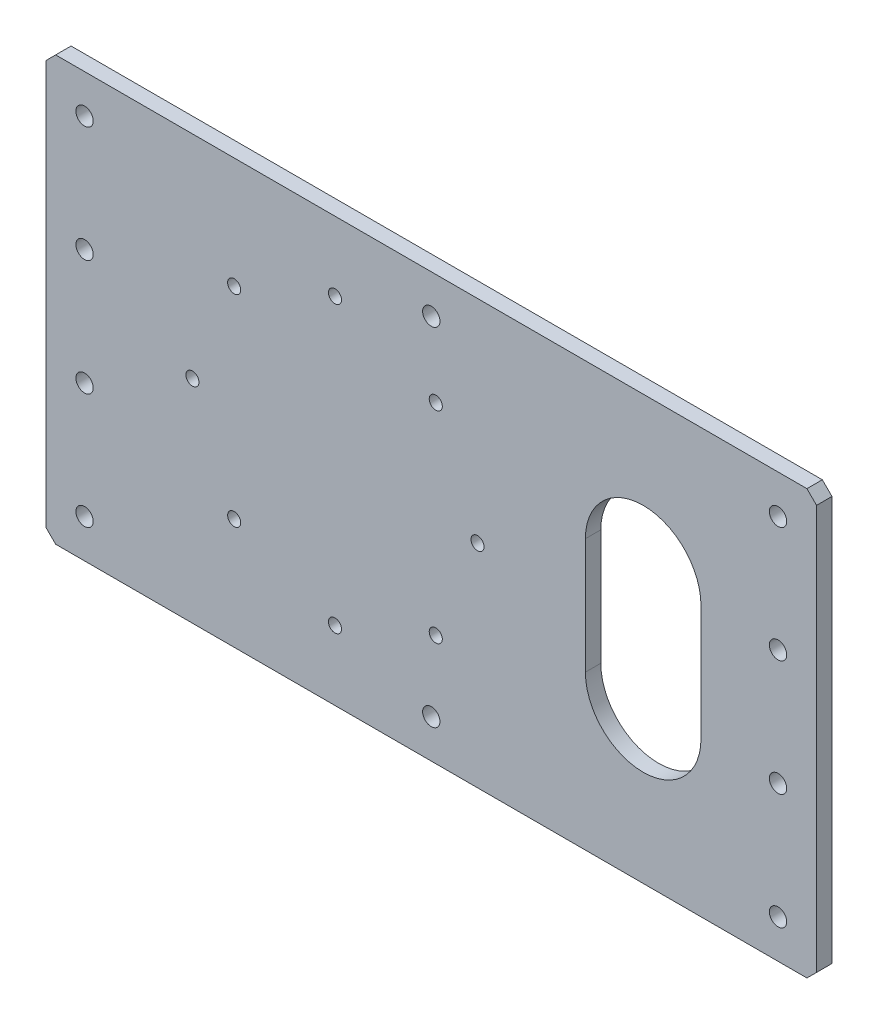
ISO-10303-21;
HEADER;
FILE_DESCRIPTION(('STEP AP214'),'2;1');
FILE_NAME('part.step','',(''),(''),'','','');
FILE_SCHEMA(('AUTOMOTIVE_DESIGN { 1 0 10303 214 1 1 1 1 }'));
ENDSEC;
DATA;
#1=APPLICATION_CONTEXT('core data for automotive mechanical design processes');
#2=APPLICATION_PROTOCOL_DEFINITION('international standard','automotive_design',2000,#1);
#3=PRODUCT_CONTEXT('',#1,'mechanical');
#4=PRODUCT('Part','Part','',(#3));
#5=PRODUCT_RELATED_PRODUCT_CATEGORY('part','',(#4));
#6=PRODUCT_DEFINITION_FORMATION('','',#4);
#7=PRODUCT_DEFINITION_CONTEXT('part definition',#1,'design');
#8=PRODUCT_DEFINITION('design','',#6,#7);
#9=PRODUCT_DEFINITION_SHAPE('','',#8);
#10=(LENGTH_UNIT() NAMED_UNIT(*) SI_UNIT(.MILLI.,.METRE.));
#11=(NAMED_UNIT(*) PLANE_ANGLE_UNIT() SI_UNIT($,.RADIAN.));
#12=(NAMED_UNIT(*) SI_UNIT($,.STERADIAN.) SOLID_ANGLE_UNIT());
#13=UNCERTAINTY_MEASURE_WITH_UNIT(LENGTH_MEASURE(1.E-05),#10,'distance_accuracy_value','');
#14=(GEOMETRIC_REPRESENTATION_CONTEXT(3) GLOBAL_UNCERTAINTY_ASSIGNED_CONTEXT((#13)) GLOBAL_UNIT_ASSIGNED_CONTEXT((#10,
#11,#12)) REPRESENTATION_CONTEXT('',''));
#15=CARTESIAN_POINT('',(0.,0.,0.));
#16=DIRECTION('',(0.,0.,1.));
#17=DIRECTION('',(1.,0.,0.));
#18=AXIS2_PLACEMENT_3D('',#15,#16,#17);
#19=CARTESIAN_POINT('',(0.,0.,0.));
#20=DIRECTION('',(0.,0.,1.));
#21=DIRECTION('',(1.,0.,0.));
#22=AXIS2_PLACEMENT_3D('',#19,#20,#21);
#23=PLANE('',#22);
#24=CARTESIAN_POINT('',(0.,90.,0.));
#25=DIRECTION('',(0.,0.,-1.));
#26=DIRECTION('',(-1.,0.,0.));
#27=AXIS2_PLACEMENT_3D('',#24,#25,#26);
#28=CIRCLE('',#27,4.5);
#29=CARTESIAN_POINT('',(-4.5,90.,0.));
#30=VERTEX_POINT('',#29);
#31=EDGE_CURVE('E271',#30,#30,#28,.T.);
#32=ORIENTED_EDGE('',*,*,#31,.F.);
#33=EDGE_LOOP('',(#32));
#34=FACE_BOUND('',#33,.T.);
#35=CARTESIAN_POINT('',(0.,-90.,0.));
#36=DIRECTION('',(0.,0.,-1.));
#37=DIRECTION('',(-1.,0.,0.));
#38=AXIS2_PLACEMENT_3D('',#35,#36,#37);
#39=CIRCLE('',#38,4.5);
#40=CARTESIAN_POINT('',(-4.5,-90.,0.));
#41=VERTEX_POINT('',#40);
#42=EDGE_CURVE('E277',#41,#41,#39,.T.);
#43=ORIENTED_EDGE('',*,*,#42,.F.);
#44=EDGE_LOOP('',(#43));
#45=FACE_BOUND('',#44,.T.);
#46=CARTESIAN_POINT('',(2.32590180780423,-52.3259018078048,0.));
#47=DIRECTION('',(0.,0.,-1.));
#48=DIRECTION('',(-1.,0.,0.));
#49=AXIS2_PLACEMENT_3D('',#46,#47,#48);
#50=CIRCLE('',#49,3.39999999999999);
#51=CARTESIAN_POINT('',(-1.07409819219576,-52.3259018078048,0.));
#52=VERTEX_POINT('',#51);
#53=EDGE_CURVE('E295',#52,#52,#50,.T.);
#54=ORIENTED_EDGE('',*,*,#53,.F.);
#55=EDGE_LOOP('',(#54));
#56=FACE_BOUND('',#55,.T.);
#57=CARTESIAN_POINT('',(-50.0000000000003,-74.,0.));
#58=DIRECTION('',(0.,0.,-1.));
#59=DIRECTION('',(-1.,0.,0.));
#60=AXIS2_PLACEMENT_3D('',#57,#58,#59);
#61=CIRCLE('',#60,3.4);
#62=CARTESIAN_POINT('',(-53.4000000000003,-74.,0.));
#63=VERTEX_POINT('',#62);
#64=EDGE_CURVE('E319',#63,#63,#61,.T.);
#65=ORIENTED_EDGE('',*,*,#64,.F.);
#66=EDGE_LOOP('',(#65));
#67=FACE_BOUND('',#66,.T.);
#68=CARTESIAN_POINT('',(24.,0.,0.));
#69=DIRECTION('',(0.,0.,-1.));
#70=DIRECTION('',(-1.,0.,0.));
#71=AXIS2_PLACEMENT_3D('',#68,#69,#70);
#72=CIRCLE('',#71,3.4);
#73=CARTESIAN_POINT('',(20.6,0.,0.));
#74=VERTEX_POINT('',#73);
#75=EDGE_CURVE('E325',#74,#74,#72,.T.);
#76=ORIENTED_EDGE('',*,*,#75,.F.);
#77=EDGE_LOOP('',(#76));
#78=FACE_BOUND('',#77,.T.);
#79=DIRECTION('',(0.,-1.,0.));
#80=VECTOR('',#79,1.);
#81=CARTESIAN_POINT('',(140.,30.,0.));
#82=LINE('',#81,#80);
#83=CARTESIAN_POINT('',(140.,30.,0.));
#84=VERTEX_POINT('',#83);
#85=CARTESIAN_POINT('',(140.,-30.,0.));
#86=VERTEX_POINT('',#85);
#87=EDGE_CURVE('E146',#84,#86,#82,.T.);
#88=ORIENTED_EDGE('',*,*,#87,.F.);
#89=CARTESIAN_POINT('',(110.,30.,0.));
#90=DIRECTION('',(0.,0.,-1.));
#91=DIRECTION('',(-1.,0.,0.));
#92=AXIS2_PLACEMENT_3D('',#89,#90,#91);
#93=CIRCLE('',#92,30.);
#94=CARTESIAN_POINT('',(80.0000000000001,30.,0.));
#95=VERTEX_POINT('',#94);
#96=EDGE_CURVE('E151',#95,#84,#93,.T.);
#97=ORIENTED_EDGE('',*,*,#96,.F.);
#98=DIRECTION('',(0.,1.,0.));
#99=VECTOR('',#98,1.);
#100=CARTESIAN_POINT('',(80.0000000000001,30.,0.));
#101=LINE('',#100,#99);
#102=CARTESIAN_POINT('',(80.0000000000001,-30.,0.));
#103=VERTEX_POINT('',#102);
#104=EDGE_CURVE('E155',#103,#95,#101,.T.);
#105=ORIENTED_EDGE('',*,*,#104,.F.);
#106=CARTESIAN_POINT('',(110.,-30.,0.));
#107=DIRECTION('',(0.,0.,-1.));
#108=DIRECTION('',(-1.,0.,0.));
#109=AXIS2_PLACEMENT_3D('',#106,#107,#108);
#110=CIRCLE('',#109,30.);
#111=EDGE_CURVE('E135',#86,#103,#110,.T.);
#112=ORIENTED_EDGE('',*,*,#111,.F.);
#113=EDGE_LOOP('',(#88,#97,#105,#112));
#114=FACE_BOUND('',#113,.T.);
#115=CARTESIAN_POINT('',(-180.,90.,0.));
#116=DIRECTION('',(0.,0.,-1.));
#117=DIRECTION('',(-1.,0.,0.));
#118=AXIS2_PLACEMENT_3D('',#115,#116,#117);
#119=CIRCLE('',#118,4.49999999999999);
#120=CARTESIAN_POINT('',(-184.5,90.,0.));
#121=VERTEX_POINT('',#120);
#122=EDGE_CURVE('E181',#121,#121,#119,.T.);
#123=ORIENTED_EDGE('',*,*,#122,.F.);
#124=EDGE_LOOP('',(#123));
#125=FACE_BOUND('',#124,.T.);
#126=CARTESIAN_POINT('',(-180.000000000001,-30.,0.));
#127=DIRECTION('',(0.,0.,-1.));
#128=DIRECTION('',(-1.,0.,0.));
#129=AXIS2_PLACEMENT_3D('',#126,#127,#128);
#130=CIRCLE('',#129,4.49999999999999);
#131=CARTESIAN_POINT('',(-184.500000000001,-30.,0.));
#132=VERTEX_POINT('',#131);
#133=EDGE_CURVE('E185',#132,#132,#130,.T.);
#134=ORIENTED_EDGE('',*,*,#133,.F.);
#135=EDGE_LOOP('',(#134));
#136=FACE_BOUND('',#135,.T.);
#137=CARTESIAN_POINT('',(-180.,-90.,0.));
#138=DIRECTION('',(0.,0.,-1.));
#139=DIRECTION('',(1.,0.,0.));
#140=AXIS2_PLACEMENT_3D('',#137,#138,#139);
#141=CIRCLE('',#140,4.49999999999999);
#142=CARTESIAN_POINT('',(-175.5,-90.,0.));
#143=VERTEX_POINT('',#142);
#144=EDGE_CURVE('E188',#143,#143,#141,.T.);
#145=ORIENTED_EDGE('',*,*,#144,.F.);
#146=EDGE_LOOP('',(#145));
#147=FACE_BOUND('',#146,.T.);
#148=CARTESIAN_POINT('',(180.,-90.,0.));
#149=DIRECTION('',(0.,0.,-1.));
#150=DIRECTION('',(-1.,0.,0.));
#151=AXIS2_PLACEMENT_3D('',#148,#149,#150);
#152=CIRCLE('',#151,4.49999999999999);
#153=CARTESIAN_POINT('',(175.5,-90.,0.));
#154=VERTEX_POINT('',#153);
#155=EDGE_CURVE('E178',#154,#154,#152,.T.);
#156=ORIENTED_EDGE('',*,*,#155,.F.);
#157=EDGE_LOOP('',(#156));
#158=FACE_BOUND('',#157,.T.);
#159=CARTESIAN_POINT('',(180.,30.,0.));
#160=DIRECTION('',(0.,0.,-1.));
#161=DIRECTION('',(1.,0.,0.));
#162=AXIS2_PLACEMENT_3D('',#159,#160,#161);
#163=CIRCLE('',#162,4.49999999999999);
#164=CARTESIAN_POINT('',(184.5,30.,0.));
#165=VERTEX_POINT('',#164);
#166=EDGE_CURVE('E171',#165,#165,#163,.T.);
#167=ORIENTED_EDGE('',*,*,#166,.F.);
#168=EDGE_LOOP('',(#167));
#169=FACE_BOUND('',#168,.T.);
#170=CARTESIAN_POINT('',(180.,90.,0.));
#171=DIRECTION('',(0.,0.,-1.));
#172=DIRECTION('',(1.,0.,0.));
#173=AXIS2_PLACEMENT_3D('',#170,#171,#172);
#174=CIRCLE('',#173,4.49999999999999);
#175=CARTESIAN_POINT('',(184.5,90.,0.));
#176=VERTEX_POINT('',#175);
#177=EDGE_CURVE('E174',#176,#176,#174,.T.);
#178=ORIENTED_EDGE('',*,*,#177,.F.);
#179=EDGE_LOOP('',(#178));
#180=FACE_BOUND('',#179,.T.);
#181=CARTESIAN_POINT('',(180.000000000001,-30.,0.));
#182=DIRECTION('',(0.,0.,-1.));
#183=DIRECTION('',(1.,0.,0.));
#184=AXIS2_PLACEMENT_3D('',#181,#182,#183);
#185=CIRCLE('',#184,4.49999999999999);
#186=CARTESIAN_POINT('',(184.500000000001,-30.,0.));
#187=VERTEX_POINT('',#186);
#188=EDGE_CURVE('E175',#187,#187,#185,.T.);
#189=ORIENTED_EDGE('',*,*,#188,.F.);
#190=EDGE_LOOP('',(#189));
#191=FACE_BOUND('',#190,.T.);
#192=CARTESIAN_POINT('',(-180.,30.,0.));
#193=DIRECTION('',(0.,0.,-1.));
#194=DIRECTION('',(-1.,0.,0.));
#195=AXIS2_PLACEMENT_3D('',#192,#193,#194);
#196=CIRCLE('',#195,4.49999999999999);
#197=CARTESIAN_POINT('',(-184.5,30.,0.));
#198=VERTEX_POINT('',#197);
#199=EDGE_CURVE('E184',#198,#198,#196,.T.);
#200=ORIENTED_EDGE('',*,*,#199,.F.);
#201=EDGE_LOOP('',(#200));
#202=FACE_BOUND('',#201,.T.);
#203=DIRECTION('',(1.,0.,0.));
#204=VECTOR('',#203,1.);
#205=CARTESIAN_POINT('',(200.,-110.,0.));
#206=LINE('',#205,#204);
#207=CARTESIAN_POINT('',(-195.,-110.,0.));
#208=VERTEX_POINT('',#207);
#209=CARTESIAN_POINT('',(195.,-110.,0.));
#210=VERTEX_POINT('',#209);
#211=EDGE_CURVE('E234',#208,#210,#206,.T.);
#212=ORIENTED_EDGE('',*,*,#211,.F.);
#213=DIRECTION('',(0.707106781186544,-0.707106781186551,0.));
#214=VECTOR('',#213,1.);
#215=CARTESIAN_POINT('',(-195.,-110.,0.));
#216=LINE('',#215,#214);
#217=CARTESIAN_POINT('',(-200.,-105.,0.));
#218=VERTEX_POINT('',#217);
#219=EDGE_CURVE('E251',#208,#218,#216,.F.);
#220=ORIENTED_EDGE('',*,*,#219,.T.);
#221=DIRECTION('',(0.,-1.,0.));
#222=VECTOR('',#221,1.);
#223=CARTESIAN_POINT('',(-200.,-110.,0.));
#224=LINE('',#223,#222);
#225=CARTESIAN_POINT('',(-200.,105.,0.));
#226=VERTEX_POINT('',#225);
#227=EDGE_CURVE('E219',#226,#218,#224,.T.);
#228=ORIENTED_EDGE('',*,*,#227,.F.);
#229=DIRECTION('',(-0.707106781186548,-0.707106781186548,0.));
#230=VECTOR('',#229,1.);
#231=CARTESIAN_POINT('',(-200.,105.,0.));
#232=LINE('',#231,#230);
#233=CARTESIAN_POINT('',(-195.,110.,0.));
#234=VERTEX_POINT('',#233);
#235=EDGE_CURVE('E249',#226,#234,#232,.F.);
#236=ORIENTED_EDGE('',*,*,#235,.T.);
#237=DIRECTION('',(-1.,0.,0.));
#238=VECTOR('',#237,1.);
#239=CARTESIAN_POINT('',(200.,110.,0.));
#240=LINE('',#239,#238);
#241=CARTESIAN_POINT('',(195.,110.,0.));
#242=VERTEX_POINT('',#241);
#243=EDGE_CURVE('E224',#242,#234,#240,.T.);
#244=ORIENTED_EDGE('',*,*,#243,.F.);
#245=DIRECTION('',(-0.707106781186544,0.707106781186551,0.));
#246=VECTOR('',#245,1.);
#247=CARTESIAN_POINT('',(195.,110.,0.));
#248=LINE('',#247,#246);
#249=CARTESIAN_POINT('',(200.,105.,0.));
#250=VERTEX_POINT('',#249);
#251=EDGE_CURVE('E245',#242,#250,#248,.F.);
#252=ORIENTED_EDGE('',*,*,#251,.T.);
#253=DIRECTION('',(0.,1.,0.));
#254=VECTOR('',#253,1.);
#255=CARTESIAN_POINT('',(200.,-110.,0.));
#256=LINE('',#255,#254);
#257=CARTESIAN_POINT('',(200.,-105.,0.));
#258=VERTEX_POINT('',#257);
#259=EDGE_CURVE('E237',#258,#250,#256,.T.);
#260=ORIENTED_EDGE('',*,*,#259,.F.);
#261=DIRECTION('',(0.707106781186551,0.707106781186544,0.));
#262=VECTOR('',#261,1.);
#263=CARTESIAN_POINT('',(200.,-105.,0.));
#264=LINE('',#263,#262);
#265=EDGE_CURVE('E247',#258,#210,#264,.F.);
#266=ORIENTED_EDGE('',*,*,#265,.T.);
#267=EDGE_LOOP('',(#212,#220,#228,#236,#244,#252,#260,#266));
#268=FACE_BOUND('',#267,.T.);
#269=CARTESIAN_POINT('',(-124.,5.22151766269019E-13,0.));
#270=DIRECTION('',(0.,0.,-1.));
#271=DIRECTION('',(-1.,0.,0.));
#272=AXIS2_PLACEMENT_3D('',#269,#270,#271);
#273=CIRCLE('',#272,3.4);
#274=CARTESIAN_POINT('',(-127.4,5.22151766269019E-13,0.));
#275=VERTEX_POINT('',#274);
#276=EDGE_CURVE('E313',#275,#275,#273,.T.);
#277=ORIENTED_EDGE('',*,*,#276,.F.);
#278=EDGE_LOOP('',(#277));
#279=FACE_BOUND('',#278,.T.);
#280=CARTESIAN_POINT('',(-49.9999999999992,74.,0.));
#281=DIRECTION('',(0.,0.,-1.));
#282=DIRECTION('',(-1.,0.,0.));
#283=AXIS2_PLACEMENT_3D('',#280,#281,#282);
#284=CIRCLE('',#283,3.4);
#285=CARTESIAN_POINT('',(-53.3999999999992,74.,0.));
#286=VERTEX_POINT('',#285);
#287=EDGE_CURVE('E307',#286,#286,#284,.T.);
#288=ORIENTED_EDGE('',*,*,#287,.F.);
#289=EDGE_LOOP('',(#288));
#290=FACE_BOUND('',#289,.T.);
#291=CARTESIAN_POINT('',(2.32590180780478,52.3259018078042,0.));
#292=DIRECTION('',(0.,0.,-1.));
#293=DIRECTION('',(-1.,0.,0.));
#294=AXIS2_PLACEMENT_3D('',#291,#292,#293);
#295=CIRCLE('',#294,3.39999999999999);
#296=CARTESIAN_POINT('',(-1.07409819219521,52.3259018078042,0.));
#297=VERTEX_POINT('',#296);
#298=EDGE_CURVE('E301',#297,#297,#295,.T.);
#299=ORIENTED_EDGE('',*,*,#298,.F.);
#300=EDGE_LOOP('',(#299));
#301=FACE_BOUND('',#300,.T.);
#302=CARTESIAN_POINT('',(-102.325901807804,-52.3259018078054,0.));
#303=DIRECTION('',(0.,0.,-1.));
#304=DIRECTION('',(-1.,0.,0.));
#305=AXIS2_PLACEMENT_3D('',#302,#303,#304);
#306=CIRCLE('',#305,3.39999999999999);
#307=CARTESIAN_POINT('',(-105.725901807804,-52.3259018078054,0.));
#308=VERTEX_POINT('',#307);
#309=EDGE_CURVE('E289',#308,#308,#306,.T.);
#310=ORIENTED_EDGE('',*,*,#309,.F.);
#311=EDGE_LOOP('',(#310));
#312=FACE_BOUND('',#311,.T.);
#313=CARTESIAN_POINT('',(-102.325901807804,52.3259018078051,0.));
#314=DIRECTION('',(0.,0.,-1.));
#315=DIRECTION('',(-1.,0.,0.));
#316=AXIS2_PLACEMENT_3D('',#313,#314,#315);
#317=CIRCLE('',#316,3.39999999999999);
#318=CARTESIAN_POINT('',(-105.725901807804,52.3259018078051,0.));
#319=VERTEX_POINT('',#318);
#320=EDGE_CURVE('E275',#319,#319,#317,.T.);
#321=ORIENTED_EDGE('',*,*,#320,.F.);
#322=EDGE_LOOP('',(#321));
#323=FACE_BOUND('',#322,.T.);
#324=ADVANCED_FACE('F37',(#34,#45,#56,#67,#78,#114,#125,#136,#147,#158,#169,#180,#191,#202,#268,
#279,#290,#301,#312,#323),#23,.F.);
#325=CARTESIAN_POINT('',(0.,0.,8.));
#326=DIRECTION('',(0.,0.,1.));
#327=DIRECTION('',(1.,0.,0.));
#328=AXIS2_PLACEMENT_3D('',#325,#326,#327);
#329=PLANE('',#328);
#330=CARTESIAN_POINT('',(0.,90.,8.));
#331=DIRECTION('',(0.,0.,1.));
#332=DIRECTION('',(1.,0.,0.));
#333=AXIS2_PLACEMENT_3D('',#330,#331,#332);
#334=CIRCLE('',#333,4.5);
#335=CARTESIAN_POINT('',(4.5,90.,8.));
#336=VERTEX_POINT('',#335);
#337=EDGE_CURVE('E41',#336,#336,#334,.T.);
#338=ORIENTED_EDGE('',*,*,#337,.F.);
#339=EDGE_LOOP('',(#338));
#340=FACE_BOUND('',#339,.T.);
#341=CARTESIAN_POINT('',(0.,-90.,8.));
#342=DIRECTION('',(0.,0.,1.));
#343=DIRECTION('',(1.,0.,0.));
#344=AXIS2_PLACEMENT_3D('',#341,#342,#343);
#345=CIRCLE('',#344,4.5);
#346=CARTESIAN_POINT('',(4.5,-90.,8.));
#347=VERTEX_POINT('',#346);
#348=EDGE_CURVE('E269',#347,#347,#345,.T.);
#349=ORIENTED_EDGE('',*,*,#348,.F.);
#350=EDGE_LOOP('',(#349));
#351=FACE_BOUND('',#350,.T.);
#352=CARTESIAN_POINT('',(-102.325901807804,52.3259018078051,8.));
#353=DIRECTION('',(0.,0.,-1.));
#354=DIRECTION('',(-1.,0.,0.));
#355=AXIS2_PLACEMENT_3D('',#352,#353,#354);
#356=CIRCLE('',#355,3.4);
#357=CARTESIAN_POINT('',(-105.725901807804,52.3259018078051,8.));
#358=VERTEX_POINT('',#357);
#359=EDGE_CURVE('E286',#358,#358,#356,.T.);
#360=ORIENTED_EDGE('',*,*,#359,.T.);
#361=EDGE_LOOP('',(#360));
#362=FACE_BOUND('',#361,.T.);
#363=CARTESIAN_POINT('',(-124.,5.22151766269019E-13,8.));
#364=DIRECTION('',(0.,0.,-1.));
#365=DIRECTION('',(-1.,0.,0.));
#366=AXIS2_PLACEMENT_3D('',#363,#364,#365);
#367=CIRCLE('',#366,3.4);
#368=CARTESIAN_POINT('',(-127.4,5.22151766269019E-13,8.));
#369=VERTEX_POINT('',#368);
#370=EDGE_CURVE('E316',#369,#369,#367,.T.);
#371=ORIENTED_EDGE('',*,*,#370,.T.);
#372=EDGE_LOOP('',(#371));
#373=FACE_BOUND('',#372,.T.);
#374=DIRECTION('',(0.,-1.,0.));
#375=VECTOR('',#374,1.);
#376=CARTESIAN_POINT('',(-200.,-110.,8.));
#377=LINE('',#376,#375);
#378=CARTESIAN_POINT('',(-200.,105.,8.));
#379=VERTEX_POINT('',#378);
#380=CARTESIAN_POINT('',(-200.,-105.,8.));
#381=VERTEX_POINT('',#380);
#382=EDGE_CURVE('E220',#379,#381,#377,.T.);
#383=ORIENTED_EDGE('',*,*,#382,.T.);
#384=DIRECTION('',(-0.707106781186544,0.707106781186551,0.));
#385=VECTOR('',#384,1.);
#386=CARTESIAN_POINT('',(-152.500000000001,-152.499999999999,8.));
#387=LINE('',#386,#385);
#388=CARTESIAN_POINT('',(-195.,-110.,8.));
#389=VERTEX_POINT('',#388);
#390=EDGE_CURVE('E263',#381,#389,#387,.F.);
#391=ORIENTED_EDGE('',*,*,#390,.T.);
#392=DIRECTION('',(1.,0.,0.));
#393=VECTOR('',#392,1.);
#394=CARTESIAN_POINT('',(200.,-110.,8.));
#395=LINE('',#394,#393);
#396=CARTESIAN_POINT('',(195.,-110.,8.));
#397=VERTEX_POINT('',#396);
#398=EDGE_CURVE('E223',#389,#397,#395,.T.);
#399=ORIENTED_EDGE('',*,*,#398,.T.);
#400=DIRECTION('',(-0.707106781186551,-0.707106781186544,0.));
#401=VECTOR('',#400,1.);
#402=CARTESIAN_POINT('',(152.499999999999,-152.500000000001,8.));
#403=LINE('',#402,#401);
#404=CARTESIAN_POINT('',(200.,-105.,8.));
#405=VERTEX_POINT('',#404);
#406=EDGE_CURVE('E259',#397,#405,#403,.F.);
#407=ORIENTED_EDGE('',*,*,#406,.T.);
#408=DIRECTION('',(0.,1.,0.));
#409=VECTOR('',#408,1.);
#410=CARTESIAN_POINT('',(200.,-110.,8.));
#411=LINE('',#410,#409);
#412=CARTESIAN_POINT('',(200.,105.,8.));
#413=VERTEX_POINT('',#412);
#414=EDGE_CURVE('E227',#405,#413,#411,.T.);
#415=ORIENTED_EDGE('',*,*,#414,.T.);
#416=DIRECTION('',(0.707106781186544,-0.707106781186551,0.));
#417=VECTOR('',#416,1.);
#418=CARTESIAN_POINT('',(152.500000000001,152.499999999999,8.));
#419=LINE('',#418,#417);
#420=CARTESIAN_POINT('',(195.,110.,8.));
#421=VERTEX_POINT('',#420);
#422=EDGE_CURVE('E61',#413,#421,#419,.F.);
#423=ORIENTED_EDGE('',*,*,#422,.T.);
#424=DIRECTION('',(-1.,0.,0.));
#425=VECTOR('',#424,1.);
#426=CARTESIAN_POINT('',(200.,110.,8.));
#427=LINE('',#426,#425);
#428=CARTESIAN_POINT('',(-195.,110.,8.));
#429=VERTEX_POINT('',#428);
#430=EDGE_CURVE('E229',#421,#429,#427,.T.);
#431=ORIENTED_EDGE('',*,*,#430,.T.);
#432=DIRECTION('',(0.707106781186548,0.707106781186548,0.));
#433=VECTOR('',#432,1.);
#434=CARTESIAN_POINT('',(-152.5,152.5,8.));
#435=LINE('',#434,#433);
#436=EDGE_CURVE('E261',#429,#379,#435,.F.);
#437=ORIENTED_EDGE('',*,*,#436,.T.);
#438=EDGE_LOOP('',(#383,#391,#399,#407,#415,#423,#431,#437));
#439=FACE_BOUND('',#438,.T.);
#440=CARTESIAN_POINT('',(-180.,30.,8.));
#441=DIRECTION('',(0.,0.,1.));
#442=DIRECTION('',(1.,0.,0.));
#443=AXIS2_PLACEMENT_3D('',#440,#441,#442);
#444=CIRCLE('',#443,4.49999999999999);
#445=CARTESIAN_POINT('',(-175.5,30.,8.));
#446=VERTEX_POINT('',#445);
#447=EDGE_CURVE('E195',#446,#446,#444,.T.);
#448=ORIENTED_EDGE('',*,*,#447,.F.);
#449=EDGE_LOOP('',(#448));
#450=FACE_BOUND('',#449,.T.);
#451=CARTESIAN_POINT('',(180.000000000001,-30.,8.));
#452=DIRECTION('',(0.,0.,1.));
#453=DIRECTION('',(1.,0.,0.));
#454=AXIS2_PLACEMENT_3D('',#451,#452,#453);
#455=CIRCLE('',#454,4.49999999999999);
#456=CARTESIAN_POINT('',(184.500000000001,-30.,8.));
#457=VERTEX_POINT('',#456);
#458=EDGE_CURVE('E198',#457,#457,#455,.T.);
#459=ORIENTED_EDGE('',*,*,#458,.F.);
#460=EDGE_LOOP('',(#459));
#461=FACE_BOUND('',#460,.T.);
#462=CARTESIAN_POINT('',(180.,90.,8.));
#463=DIRECTION('',(0.,0.,1.));
#464=DIRECTION('',(1.,0.,0.));
#465=AXIS2_PLACEMENT_3D('',#462,#463,#464);
#466=CIRCLE('',#465,4.49999999999999);
#467=CARTESIAN_POINT('',(184.5,90.,8.));
#468=VERTEX_POINT('',#467);
#469=EDGE_CURVE('E201',#468,#468,#466,.T.);
#470=ORIENTED_EDGE('',*,*,#469,.F.);
#471=EDGE_LOOP('',(#470));
#472=FACE_BOUND('',#471,.T.);
#473=CARTESIAN_POINT('',(180.,30.,8.));
#474=DIRECTION('',(0.,0.,1.));
#475=DIRECTION('',(1.,0.,0.));
#476=AXIS2_PLACEMENT_3D('',#473,#474,#475);
#477=CIRCLE('',#476,4.49999999999999);
#478=CARTESIAN_POINT('',(184.5,30.,8.));
#479=VERTEX_POINT('',#478);
#480=EDGE_CURVE('E204',#479,#479,#477,.T.);
#481=ORIENTED_EDGE('',*,*,#480,.F.);
#482=EDGE_LOOP('',(#481));
#483=FACE_BOUND('',#482,.T.);
#484=CARTESIAN_POINT('',(180.,-90.,8.));
#485=DIRECTION('',(0.,0.,1.));
#486=DIRECTION('',(1.,0.,0.));
#487=AXIS2_PLACEMENT_3D('',#484,#485,#486);
#488=CIRCLE('',#487,4.49999999999999);
#489=CARTESIAN_POINT('',(184.5,-90.,8.));
#490=VERTEX_POINT('',#489);
#491=EDGE_CURVE('E207',#490,#490,#488,.T.);
#492=ORIENTED_EDGE('',*,*,#491,.F.);
#493=EDGE_LOOP('',(#492));
#494=FACE_BOUND('',#493,.T.);
#495=CARTESIAN_POINT('',(-180.,-90.,8.));
#496=DIRECTION('',(0.,0.,1.));
#497=DIRECTION('',(1.,0.,0.));
#498=AXIS2_PLACEMENT_3D('',#495,#496,#497);
#499=CIRCLE('',#498,4.49999999999999);
#500=CARTESIAN_POINT('',(-175.5,-90.,8.));
#501=VERTEX_POINT('',#500);
#502=EDGE_CURVE('E210',#501,#501,#499,.T.);
#503=ORIENTED_EDGE('',*,*,#502,.F.);
#504=EDGE_LOOP('',(#503));
#505=FACE_BOUND('',#504,.T.);
#506=CARTESIAN_POINT('',(-180.000000000001,-30.,8.));
#507=DIRECTION('',(0.,0.,1.));
#508=DIRECTION('',(1.,0.,0.));
#509=AXIS2_PLACEMENT_3D('',#506,#507,#508);
#510=CIRCLE('',#509,4.49999999999999);
#511=CARTESIAN_POINT('',(-175.500000000001,-30.,8.));
#512=VERTEX_POINT('',#511);
#513=EDGE_CURVE('E213',#512,#512,#510,.T.);
#514=ORIENTED_EDGE('',*,*,#513,.F.);
#515=EDGE_LOOP('',(#514));
#516=FACE_BOUND('',#515,.T.);
#517=CARTESIAN_POINT('',(-180.,90.,8.));
#518=DIRECTION('',(0.,0.,1.));
#519=DIRECTION('',(1.,0.,0.));
#520=AXIS2_PLACEMENT_3D('',#517,#518,#519);
#521=CIRCLE('',#520,4.49999999999999);
#522=CARTESIAN_POINT('',(-175.5,90.,8.));
#523=VERTEX_POINT('',#522);
#524=EDGE_CURVE('E216',#523,#523,#521,.T.);
#525=ORIENTED_EDGE('',*,*,#524,.F.);
#526=EDGE_LOOP('',(#525));
#527=FACE_BOUND('',#526,.T.);
#528=CARTESIAN_POINT('',(110.,30.,8.));
#529=DIRECTION('',(0.,0.,1.));
#530=DIRECTION('',(1.,0.,0.));
#531=AXIS2_PLACEMENT_3D('',#528,#529,#530);
#532=CIRCLE('',#531,30.);
#533=CARTESIAN_POINT('',(140.,30.,8.));
#534=VERTEX_POINT('',#533);
#535=CARTESIAN_POINT('',(80.0000000000001,30.,8.));
#536=VERTEX_POINT('',#535);
#537=EDGE_CURVE('E169',#534,#536,#532,.T.);
#538=ORIENTED_EDGE('',*,*,#537,.F.);
#539=DIRECTION('',(0.,1.,0.));
#540=VECTOR('',#539,1.);
#541=CARTESIAN_POINT('',(140.,0.,8.));
#542=LINE('',#541,#540);
#543=CARTESIAN_POINT('',(140.,-30.,8.));
#544=VERTEX_POINT('',#543);
#545=EDGE_CURVE('E162',#544,#534,#542,.T.);
#546=ORIENTED_EDGE('',*,*,#545,.F.);
#547=CARTESIAN_POINT('',(110.,-30.,8.));
#548=DIRECTION('',(0.,0.,1.));
#549=DIRECTION('',(1.,0.,0.));
#550=AXIS2_PLACEMENT_3D('',#547,#548,#549);
#551=CIRCLE('',#550,30.);
#552=CARTESIAN_POINT('',(80.0000000000001,-30.,8.));
#553=VERTEX_POINT('',#552);
#554=EDGE_CURVE('E138',#553,#544,#551,.T.);
#555=ORIENTED_EDGE('',*,*,#554,.F.);
#556=DIRECTION('',(0.,-1.,0.));
#557=VECTOR('',#556,1.);
#558=CARTESIAN_POINT('',(80.0000000000001,0.,8.));
#559=LINE('',#558,#557);
#560=EDGE_CURVE('E167',#536,#553,#559,.T.);
#561=ORIENTED_EDGE('',*,*,#560,.F.);
#562=EDGE_LOOP('',(#538,#546,#555,#561));
#563=FACE_BOUND('',#562,.T.);
#564=CARTESIAN_POINT('',(24.,0.,8.));
#565=DIRECTION('',(0.,0.,-1.));
#566=DIRECTION('',(-1.,0.,0.));
#567=AXIS2_PLACEMENT_3D('',#564,#565,#566);
#568=CIRCLE('',#567,3.4);
#569=CARTESIAN_POINT('',(20.6,0.,8.));
#570=VERTEX_POINT('',#569);
#571=EDGE_CURVE('E328',#570,#570,#568,.T.);
#572=ORIENTED_EDGE('',*,*,#571,.T.);
#573=EDGE_LOOP('',(#572));
#574=FACE_BOUND('',#573,.T.);
#575=CARTESIAN_POINT('',(-50.0000000000003,-74.,8.));
#576=DIRECTION('',(0.,0.,-1.));
#577=DIRECTION('',(-1.,0.,0.));
#578=AXIS2_PLACEMENT_3D('',#575,#576,#577);
#579=CIRCLE('',#578,3.39999999999999);
#580=CARTESIAN_POINT('',(-53.4000000000003,-74.,8.));
#581=VERTEX_POINT('',#580);
#582=EDGE_CURVE('E322',#581,#581,#579,.T.);
#583=ORIENTED_EDGE('',*,*,#582,.T.);
#584=EDGE_LOOP('',(#583));
#585=FACE_BOUND('',#584,.T.);
#586=CARTESIAN_POINT('',(-49.9999999999992,74.,8.));
#587=DIRECTION('',(0.,0.,-1.));
#588=DIRECTION('',(-1.,0.,0.));
#589=AXIS2_PLACEMENT_3D('',#586,#587,#588);
#590=CIRCLE('',#589,3.39999999999999);
#591=CARTESIAN_POINT('',(-53.3999999999992,74.,8.));
#592=VERTEX_POINT('',#591);
#593=EDGE_CURVE('E310',#592,#592,#590,.T.);
#594=ORIENTED_EDGE('',*,*,#593,.T.);
#595=EDGE_LOOP('',(#594));
#596=FACE_BOUND('',#595,.T.);
#597=CARTESIAN_POINT('',(2.32590180780478,52.3259018078042,8.));
#598=DIRECTION('',(0.,0.,-1.));
#599=DIRECTION('',(-1.,0.,0.));
#600=AXIS2_PLACEMENT_3D('',#597,#598,#599);
#601=CIRCLE('',#600,3.4);
#602=CARTESIAN_POINT('',(-1.07409819219522,52.3259018078042,8.));
#603=VERTEX_POINT('',#602);
#604=EDGE_CURVE('E304',#603,#603,#601,.T.);
#605=ORIENTED_EDGE('',*,*,#604,.T.);
#606=EDGE_LOOP('',(#605));
#607=FACE_BOUND('',#606,.T.);
#608=CARTESIAN_POINT('',(2.32590180780423,-52.3259018078048,8.));
#609=DIRECTION('',(0.,0.,-1.));
#610=DIRECTION('',(-1.,0.,0.));
#611=AXIS2_PLACEMENT_3D('',#608,#609,#610);
#612=CIRCLE('',#611,3.4);
#613=CARTESIAN_POINT('',(-1.07409819219577,-52.3259018078048,8.));
#614=VERTEX_POINT('',#613);
#615=EDGE_CURVE('E298',#614,#614,#612,.T.);
#616=ORIENTED_EDGE('',*,*,#615,.T.);
#617=EDGE_LOOP('',(#616));
#618=FACE_BOUND('',#617,.T.);
#619=CARTESIAN_POINT('',(-102.325901807804,-52.3259018078054,8.));
#620=DIRECTION('',(0.,0.,-1.));
#621=DIRECTION('',(-1.,0.,0.));
#622=AXIS2_PLACEMENT_3D('',#619,#620,#621);
#623=CIRCLE('',#622,3.4);
#624=CARTESIAN_POINT('',(-105.725901807804,-52.3259018078054,8.));
#625=VERTEX_POINT('',#624);
#626=EDGE_CURVE('E292',#625,#625,#623,.T.);
#627=ORIENTED_EDGE('',*,*,#626,.T.);
#628=EDGE_LOOP('',(#627));
#629=FACE_BOUND('',#628,.T.);
#630=ADVANCED_FACE('F338',(#340,#351,#362,#373,#439,#450,#461,#472,#483,#494,#505,#516,#527,
#563,#574,#585,#596,#607,#618,#629),#329,.T.);
#631=CARTESIAN_POINT('',(-200.,-110.,8.));
#632=DIRECTION('',(1.,0.,0.));
#633=DIRECTION('',(0.,0.,-1.));
#634=AXIS2_PLACEMENT_3D('',#631,#632,#633);
#635=PLANE('',#634);
#636=ORIENTED_EDGE('',*,*,#227,.T.);
#637=DIRECTION('',(0.,0.,1.));
#638=VECTOR('',#637,1.);
#639=CARTESIAN_POINT('',(-200.,-105.,8.));
#640=LINE('',#639,#638);
#641=EDGE_CURVE('E256',#218,#381,#640,.T.);
#642=ORIENTED_EDGE('',*,*,#641,.T.);
#643=ORIENTED_EDGE('',*,*,#382,.F.);
#644=DIRECTION('',(0.,0.,-1.));
#645=VECTOR('',#644,1.);
#646=CARTESIAN_POINT('',(-200.,105.,8.));
#647=LINE('',#646,#645);
#648=EDGE_CURVE('E253',#379,#226,#647,.T.);
#649=ORIENTED_EDGE('',*,*,#648,.T.);
#650=EDGE_LOOP('',(#636,#642,#643,#649));
#651=FACE_BOUND('',#650,.T.);
#652=ADVANCED_FACE('F341',(#651),#635,.F.);
#653=CARTESIAN_POINT('',(200.,-110.,8.));
#654=DIRECTION('',(0.,1.,0.));
#655=DIRECTION('',(-1.,0.,0.));
#656=AXIS2_PLACEMENT_3D('',#653,#654,#655);
#657=PLANE('',#656);
#658=ORIENTED_EDGE('',*,*,#398,.F.);
#659=DIRECTION('',(0.,0.,-1.));
#660=VECTOR('',#659,1.);
#661=CARTESIAN_POINT('',(-195.,-110.,8.));
#662=LINE('',#661,#660);
#663=EDGE_CURVE('E242',#389,#208,#662,.T.);
#664=ORIENTED_EDGE('',*,*,#663,.T.);
#665=ORIENTED_EDGE('',*,*,#211,.T.);
#666=DIRECTION('',(0.,0.,1.));
#667=VECTOR('',#666,1.);
#668=CARTESIAN_POINT('',(195.,-110.,8.));
#669=LINE('',#668,#667);
#670=EDGE_CURVE('E231',#210,#397,#669,.T.);
#671=ORIENTED_EDGE('',*,*,#670,.T.);
#672=EDGE_LOOP('',(#658,#664,#665,#671));
#673=FACE_BOUND('',#672,.T.);
#674=ADVANCED_FACE('F454',(#673),#657,.F.);
#675=CARTESIAN_POINT('',(200.,-110.,8.));
#676=DIRECTION('',(-1.,0.,0.));
#677=DIRECTION('',(0.,0.,1.));
#678=AXIS2_PLACEMENT_3D('',#675,#676,#677);
#679=PLANE('',#678);
#680=ORIENTED_EDGE('',*,*,#414,.F.);
#681=DIRECTION('',(0.,0.,-1.));
#682=VECTOR('',#681,1.);
#683=CARTESIAN_POINT('',(200.,-105.,8.));
#684=LINE('',#683,#682);
#685=EDGE_CURVE('E11',#405,#258,#684,.T.);
#686=ORIENTED_EDGE('',*,*,#685,.T.);
#687=ORIENTED_EDGE('',*,*,#259,.T.);
#688=DIRECTION('',(0.,0.,1.));
#689=VECTOR('',#688,1.);
#690=CARTESIAN_POINT('',(200.,105.,8.));
#691=LINE('',#690,#689);
#692=EDGE_CURVE('E46',#250,#413,#691,.T.);
#693=ORIENTED_EDGE('',*,*,#692,.T.);
#694=EDGE_LOOP('',(#680,#686,#687,#693));
#695=FACE_BOUND('',#694,.T.);
#696=ADVANCED_FACE('F451',(#695),#679,.F.);
#697=CARTESIAN_POINT('',(200.,110.,8.));
#698=DIRECTION('',(0.,-1.,0.));
#699=DIRECTION('',(1.,0.,0.));
#700=AXIS2_PLACEMENT_3D('',#697,#698,#699);
#701=PLANE('',#700);
#702=ORIENTED_EDGE('',*,*,#243,.T.);
#703=DIRECTION('',(0.,0.,1.));
#704=VECTOR('',#703,1.);
#705=CARTESIAN_POINT('',(-195.,110.,8.));
#706=LINE('',#705,#704);
#707=EDGE_CURVE('E54',#234,#429,#706,.T.);
#708=ORIENTED_EDGE('',*,*,#707,.T.);
#709=ORIENTED_EDGE('',*,*,#430,.F.);
#710=DIRECTION('',(0.,0.,-1.));
#711=VECTOR('',#710,1.);
#712=CARTESIAN_POINT('',(195.,110.,8.));
#713=LINE('',#712,#711);
#714=EDGE_CURVE('E265',#421,#242,#713,.T.);
#715=ORIENTED_EDGE('',*,*,#714,.T.);
#716=EDGE_LOOP('',(#702,#708,#709,#715));
#717=FACE_BOUND('',#716,.T.);
#718=ADVANCED_FACE('F446',(#717),#701,.F.);
#719=CARTESIAN_POINT('',(-180.,30.,10.));
#720=DIRECTION('',(0.,0.,-1.));
#721=DIRECTION('',(-1.,0.,0.));
#722=AXIS2_PLACEMENT_3D('',#719,#720,#721);
#723=CYLINDRICAL_SURFACE('',#722,4.49999999999999);
#724=ORIENTED_EDGE('',*,*,#447,.T.);
#725=EDGE_LOOP('',(#724));
#726=FACE_BOUND('',#725,.T.);
#727=ORIENTED_EDGE('',*,*,#199,.T.);
#728=EDGE_LOOP('',(#727));
#729=FACE_BOUND('',#728,.T.);
#730=ADVANCED_FACE('F426',(#726,#729),#723,.F.);
#731=CARTESIAN_POINT('',(180.000000000001,-30.,10.));
#732=DIRECTION('',(0.,0.,-1.));
#733=DIRECTION('',(-1.,0.,0.));
#734=AXIS2_PLACEMENT_3D('',#731,#732,#733);
#735=CYLINDRICAL_SURFACE('',#734,4.49999999999999);
#736=ORIENTED_EDGE('',*,*,#458,.T.);
#737=EDGE_LOOP('',(#736));
#738=FACE_BOUND('',#737,.T.);
#739=ORIENTED_EDGE('',*,*,#188,.T.);
#740=EDGE_LOOP('',(#739));
#741=FACE_BOUND('',#740,.T.);
#742=ADVANCED_FACE('F423',(#738,#741),#735,.F.);
#743=CARTESIAN_POINT('',(180.,90.,10.));
#744=DIRECTION('',(0.,0.,-1.));
#745=DIRECTION('',(-1.,0.,0.));
#746=AXIS2_PLACEMENT_3D('',#743,#744,#745);
#747=CYLINDRICAL_SURFACE('',#746,4.49999999999999);
#748=ORIENTED_EDGE('',*,*,#469,.T.);
#749=EDGE_LOOP('',(#748));
#750=FACE_BOUND('',#749,.T.);
#751=ORIENTED_EDGE('',*,*,#177,.T.);
#752=EDGE_LOOP('',(#751));
#753=FACE_BOUND('',#752,.T.);
#754=ADVANCED_FACE('F421',(#750,#753),#747,.F.);
#755=CARTESIAN_POINT('',(180.,30.,10.));
#756=DIRECTION('',(0.,0.,-1.));
#757=DIRECTION('',(-1.,0.,0.));
#758=AXIS2_PLACEMENT_3D('',#755,#756,#757);
#759=CYLINDRICAL_SURFACE('',#758,4.49999999999999);
#760=ORIENTED_EDGE('',*,*,#480,.T.);
#761=EDGE_LOOP('',(#760));
#762=FACE_BOUND('',#761,.T.);
#763=ORIENTED_EDGE('',*,*,#166,.T.);
#764=EDGE_LOOP('',(#763));
#765=FACE_BOUND('',#764,.T.);
#766=ADVANCED_FACE('F417',(#762,#765),#759,.F.);
#767=CARTESIAN_POINT('',(180.,-90.,10.));
#768=DIRECTION('',(0.,0.,-1.));
#769=DIRECTION('',(-1.,0.,0.));
#770=AXIS2_PLACEMENT_3D('',#767,#768,#769);
#771=CYLINDRICAL_SURFACE('',#770,4.49999999999999);
#772=ORIENTED_EDGE('',*,*,#491,.T.);
#773=EDGE_LOOP('',(#772));
#774=FACE_BOUND('',#773,.T.);
#775=ORIENTED_EDGE('',*,*,#155,.T.);
#776=EDGE_LOOP('',(#775));
#777=FACE_BOUND('',#776,.T.);
#778=ADVANCED_FACE('F420',(#774,#777),#771,.F.);
#779=CARTESIAN_POINT('',(-180.,-90.,10.));
#780=DIRECTION('',(0.,0.,-1.));
#781=DIRECTION('',(-1.,0.,0.));
#782=AXIS2_PLACEMENT_3D('',#779,#780,#781);
#783=CYLINDRICAL_SURFACE('',#782,4.49999999999999);
#784=ORIENTED_EDGE('',*,*,#502,.T.);
#785=EDGE_LOOP('',(#784));
#786=FACE_BOUND('',#785,.T.);
#787=ORIENTED_EDGE('',*,*,#144,.T.);
#788=EDGE_LOOP('',(#787));
#789=FACE_BOUND('',#788,.T.);
#790=ADVANCED_FACE('F437',(#786,#789),#783,.F.);
#791=CARTESIAN_POINT('',(-180.000000000001,-30.,10.));
#792=DIRECTION('',(0.,0.,-1.));
#793=DIRECTION('',(-1.,0.,0.));
#794=AXIS2_PLACEMENT_3D('',#791,#792,#793);
#795=CYLINDRICAL_SURFACE('',#794,4.49999999999999);
#796=ORIENTED_EDGE('',*,*,#513,.T.);
#797=EDGE_LOOP('',(#796));
#798=FACE_BOUND('',#797,.T.);
#799=ORIENTED_EDGE('',*,*,#133,.T.);
#800=EDGE_LOOP('',(#799));
#801=FACE_BOUND('',#800,.T.);
#802=ADVANCED_FACE('F433',(#798,#801),#795,.F.);
#803=CARTESIAN_POINT('',(-180.,90.,10.));
#804=DIRECTION('',(0.,0.,-1.));
#805=DIRECTION('',(-1.,0.,0.));
#806=AXIS2_PLACEMENT_3D('',#803,#804,#805);
#807=CYLINDRICAL_SURFACE('',#806,4.49999999999999);
#808=ORIENTED_EDGE('',*,*,#524,.T.);
#809=EDGE_LOOP('',(#808));
#810=FACE_BOUND('',#809,.T.);
#811=ORIENTED_EDGE('',*,*,#122,.T.);
#812=EDGE_LOOP('',(#811));
#813=FACE_BOUND('',#812,.T.);
#814=ADVANCED_FACE('F416',(#810,#813),#807,.F.);
#815=CARTESIAN_POINT('',(110.,30.,10.));
#816=DIRECTION('',(0.,0.,-1.));
#817=DIRECTION('',(-1.,0.,0.));
#818=AXIS2_PLACEMENT_3D('',#815,#816,#817);
#819=CYLINDRICAL_SURFACE('',#818,30.);
#820=ORIENTED_EDGE('',*,*,#537,.T.);
#821=DIRECTION('',(0.,0.,-1.));
#822=VECTOR('',#821,1.);
#823=CARTESIAN_POINT('',(80.0000000000001,30.,10.));
#824=LINE('',#823,#822);
#825=EDGE_CURVE('E160',#536,#95,#824,.T.);
#826=ORIENTED_EDGE('',*,*,#825,.T.);
#827=ORIENTED_EDGE('',*,*,#96,.T.);
#828=DIRECTION('',(0.,0.,-1.));
#829=VECTOR('',#828,1.);
#830=CARTESIAN_POINT('',(140.,30.,10.));
#831=LINE('',#830,#829);
#832=EDGE_CURVE('E142',#534,#84,#831,.T.);
#833=ORIENTED_EDGE('',*,*,#832,.F.);
#834=EDGE_LOOP('',(#820,#826,#827,#833));
#835=FACE_BOUND('',#834,.T.);
#836=ADVANCED_FACE('F331',(#835),#819,.F.);
#837=CARTESIAN_POINT('',(80.0000000000001,30.,10.));
#838=DIRECTION('',(-1.,0.,0.));
#839=DIRECTION('',(0.,0.,1.));
#840=AXIS2_PLACEMENT_3D('',#837,#838,#839);
#841=PLANE('',#840);
#842=ORIENTED_EDGE('',*,*,#560,.T.);
#843=DIRECTION('',(0.,0.,-1.));
#844=VECTOR('',#843,1.);
#845=CARTESIAN_POINT('',(80.0000000000001,-30.,10.));
#846=LINE('',#845,#844);
#847=EDGE_CURVE('E141',#553,#103,#846,.T.);
#848=ORIENTED_EDGE('',*,*,#847,.T.);
#849=ORIENTED_EDGE('',*,*,#104,.T.);
#850=ORIENTED_EDGE('',*,*,#825,.F.);
#851=EDGE_LOOP('',(#842,#848,#849,#850));
#852=FACE_BOUND('',#851,.T.);
#853=ADVANCED_FACE('F336',(#852),#841,.F.);
#854=CARTESIAN_POINT('',(110.,-30.,10.));
#855=DIRECTION('',(0.,0.,-1.));
#856=DIRECTION('',(-1.,0.,0.));
#857=AXIS2_PLACEMENT_3D('',#854,#855,#856);
#858=CYLINDRICAL_SURFACE('',#857,30.);
#859=ORIENTED_EDGE('',*,*,#554,.T.);
#860=DIRECTION('',(0.,0.,-1.));
#861=VECTOR('',#860,1.);
#862=CARTESIAN_POINT('',(140.,-30.,10.));
#863=LINE('',#862,#861);
#864=EDGE_CURVE('E130',#544,#86,#863,.T.);
#865=ORIENTED_EDGE('',*,*,#864,.T.);
#866=ORIENTED_EDGE('',*,*,#111,.T.);
#867=ORIENTED_EDGE('',*,*,#847,.F.);
#868=EDGE_LOOP('',(#859,#865,#866,#867));
#869=FACE_BOUND('',#868,.T.);
#870=ADVANCED_FACE('F132',(#869),#858,.F.);
#871=CARTESIAN_POINT('',(140.,30.,10.));
#872=DIRECTION('',(1.,0.,0.));
#873=DIRECTION('',(0.,0.,-1.));
#874=AXIS2_PLACEMENT_3D('',#871,#872,#873);
#875=PLANE('',#874);
#876=ORIENTED_EDGE('',*,*,#545,.T.);
#877=ORIENTED_EDGE('',*,*,#832,.T.);
#878=ORIENTED_EDGE('',*,*,#87,.T.);
#879=ORIENTED_EDGE('',*,*,#864,.F.);
#880=EDGE_LOOP('',(#876,#877,#878,#879));
#881=FACE_BOUND('',#880,.T.);
#882=ADVANCED_FACE('F147',(#881),#875,.F.);
#883=CARTESIAN_POINT('',(24.,0.,0.));
#884=DIRECTION('',(0.,0.,-1.));
#885=DIRECTION('',(-1.,0.,0.));
#886=AXIS2_PLACEMENT_3D('',#883,#884,#885);
#887=CYLINDRICAL_SURFACE('',#886,3.4);
#888=ORIENTED_EDGE('',*,*,#571,.F.);
#889=EDGE_LOOP('',(#888));
#890=FACE_BOUND('',#889,.T.);
#891=ORIENTED_EDGE('',*,*,#75,.T.);
#892=EDGE_LOOP('',(#891));
#893=FACE_BOUND('',#892,.T.);
#894=ADVANCED_FACE('F403',(#890,#893),#887,.F.);
#895=CARTESIAN_POINT('',(-50.0000000000003,-74.,0.));
#896=DIRECTION('',(0.,0.,-1.));
#897=DIRECTION('',(-1.,0.,0.));
#898=AXIS2_PLACEMENT_3D('',#895,#896,#897);
#899=CYLINDRICAL_SURFACE('',#898,3.4);
#900=ORIENTED_EDGE('',*,*,#582,.F.);
#901=EDGE_LOOP('',(#900));
#902=FACE_BOUND('',#901,.T.);
#903=ORIENTED_EDGE('',*,*,#64,.T.);
#904=EDGE_LOOP('',(#903));
#905=FACE_BOUND('',#904,.T.);
#906=ADVANCED_FACE('F399',(#902,#905),#899,.F.);
#907=CARTESIAN_POINT('',(-124.,5.22151766269019E-13,0.));
#908=DIRECTION('',(0.,0.,-1.));
#909=DIRECTION('',(-1.,0.,0.));
#910=AXIS2_PLACEMENT_3D('',#907,#908,#909);
#911=CYLINDRICAL_SURFACE('',#910,3.4);
#912=ORIENTED_EDGE('',*,*,#370,.F.);
#913=EDGE_LOOP('',(#912));
#914=FACE_BOUND('',#913,.T.);
#915=ORIENTED_EDGE('',*,*,#276,.T.);
#916=EDGE_LOOP('',(#915));
#917=FACE_BOUND('',#916,.T.);
#918=ADVANCED_FACE('F395',(#914,#917),#911,.F.);
#919=CARTESIAN_POINT('',(-49.9999999999992,74.,0.));
#920=DIRECTION('',(0.,0.,-1.));
#921=DIRECTION('',(-1.,0.,0.));
#922=AXIS2_PLACEMENT_3D('',#919,#920,#921);
#923=CYLINDRICAL_SURFACE('',#922,3.4);
#924=ORIENTED_EDGE('',*,*,#593,.F.);
#925=EDGE_LOOP('',(#924));
#926=FACE_BOUND('',#925,.T.);
#927=ORIENTED_EDGE('',*,*,#287,.T.);
#928=EDGE_LOOP('',(#927));
#929=FACE_BOUND('',#928,.T.);
#930=ADVANCED_FACE('F391',(#926,#929),#923,.F.);
#931=CARTESIAN_POINT('',(2.32590180780478,52.3259018078042,0.));
#932=DIRECTION('',(0.,0.,-1.));
#933=DIRECTION('',(-1.,0.,0.));
#934=AXIS2_PLACEMENT_3D('',#931,#932,#933);
#935=CYLINDRICAL_SURFACE('',#934,3.39999999999999);
#936=ORIENTED_EDGE('',*,*,#604,.F.);
#937=EDGE_LOOP('',(#936));
#938=FACE_BOUND('',#937,.T.);
#939=ORIENTED_EDGE('',*,*,#298,.T.);
#940=EDGE_LOOP('',(#939));
#941=FACE_BOUND('',#940,.T.);
#942=ADVANCED_FACE('F387',(#938,#941),#935,.F.);
#943=CARTESIAN_POINT('',(2.32590180780423,-52.3259018078048,0.));
#944=DIRECTION('',(0.,0.,-1.));
#945=DIRECTION('',(-1.,0.,0.));
#946=AXIS2_PLACEMENT_3D('',#943,#944,#945);
#947=CYLINDRICAL_SURFACE('',#946,3.39999999999999);
#948=ORIENTED_EDGE('',*,*,#615,.F.);
#949=EDGE_LOOP('',(#948));
#950=FACE_BOUND('',#949,.T.);
#951=ORIENTED_EDGE('',*,*,#53,.T.);
#952=EDGE_LOOP('',(#951));
#953=FACE_BOUND('',#952,.T.);
#954=ADVANCED_FACE('F360',(#950,#953),#947,.F.);
#955=CARTESIAN_POINT('',(-102.325901807804,-52.3259018078054,0.));
#956=DIRECTION('',(0.,0.,-1.));
#957=DIRECTION('',(-1.,0.,0.));
#958=AXIS2_PLACEMENT_3D('',#955,#956,#957);
#959=CYLINDRICAL_SURFACE('',#958,3.39999999999999);
#960=ORIENTED_EDGE('',*,*,#626,.F.);
#961=EDGE_LOOP('',(#960));
#962=FACE_BOUND('',#961,.T.);
#963=ORIENTED_EDGE('',*,*,#309,.T.);
#964=EDGE_LOOP('',(#963));
#965=FACE_BOUND('',#964,.T.);
#966=ADVANCED_FACE('F356',(#962,#965),#959,.F.);
#967=CARTESIAN_POINT('',(-102.325901807804,52.3259018078051,0.));
#968=DIRECTION('',(0.,0.,-1.));
#969=DIRECTION('',(-1.,0.,0.));
#970=AXIS2_PLACEMENT_3D('',#967,#968,#969);
#971=CYLINDRICAL_SURFACE('',#970,3.39999999999999);
#972=ORIENTED_EDGE('',*,*,#359,.F.);
#973=EDGE_LOOP('',(#972));
#974=FACE_BOUND('',#973,.T.);
#975=ORIENTED_EDGE('',*,*,#320,.T.);
#976=EDGE_LOOP('',(#975));
#977=FACE_BOUND('',#976,.T.);
#978=ADVANCED_FACE('F359',(#974,#977),#971,.F.);
#979=CARTESIAN_POINT('',(-195.,-110.,8.));
#980=DIRECTION('',(0.707106781186551,0.707106781186544,0.));
#981=DIRECTION('',(0.,0.,-1.));
#982=AXIS2_PLACEMENT_3D('',#979,#980,#981);
#983=PLANE('',#982);
#984=ORIENTED_EDGE('',*,*,#390,.F.);
#985=ORIENTED_EDGE('',*,*,#641,.F.);
#986=ORIENTED_EDGE('',*,*,#219,.F.);
#987=ORIENTED_EDGE('',*,*,#663,.F.);
#988=EDGE_LOOP('',(#984,#985,#986,#987));
#989=FACE_BOUND('',#988,.T.);
#990=ADVANCED_FACE('F371',(#989),#983,.F.);
#991=CARTESIAN_POINT('',(-200.,105.,8.));
#992=DIRECTION('',(0.707106781186547,-0.707106781186547,0.));
#993=DIRECTION('',(0.,0.,-1.));
#994=AXIS2_PLACEMENT_3D('',#991,#992,#993);
#995=PLANE('',#994);
#996=ORIENTED_EDGE('',*,*,#436,.F.);
#997=ORIENTED_EDGE('',*,*,#707,.F.);
#998=ORIENTED_EDGE('',*,*,#235,.F.);
#999=ORIENTED_EDGE('',*,*,#648,.F.);
#1000=EDGE_LOOP('',(#996,#997,#998,#999));
#1001=FACE_BOUND('',#1000,.T.);
#1002=ADVANCED_FACE('F377',(#1001),#995,.F.);
#1003=CARTESIAN_POINT('',(200.,-105.,8.));
#1004=DIRECTION('',(-0.707106781186544,0.707106781186551,0.));
#1005=DIRECTION('',(0.,0.,-1.));
#1006=AXIS2_PLACEMENT_3D('',#1003,#1004,#1005);
#1007=PLANE('',#1006);
#1008=ORIENTED_EDGE('',*,*,#406,.F.);
#1009=ORIENTED_EDGE('',*,*,#670,.F.);
#1010=ORIENTED_EDGE('',*,*,#265,.F.);
#1011=ORIENTED_EDGE('',*,*,#685,.F.);
#1012=EDGE_LOOP('',(#1008,#1009,#1010,#1011));
#1013=FACE_BOUND('',#1012,.T.);
#1014=ADVANCED_FACE('F463',(#1013),#1007,.F.);
#1015=CARTESIAN_POINT('',(195.,110.,8.));
#1016=DIRECTION('',(-0.707106781186551,-0.707106781186544,0.));
#1017=DIRECTION('',(0.,0.,-1.));
#1018=AXIS2_PLACEMENT_3D('',#1015,#1016,#1017);
#1019=PLANE('',#1018);
#1020=ORIENTED_EDGE('',*,*,#422,.F.);
#1021=ORIENTED_EDGE('',*,*,#692,.F.);
#1022=ORIENTED_EDGE('',*,*,#251,.F.);
#1023=ORIENTED_EDGE('',*,*,#714,.F.);
#1024=EDGE_LOOP('',(#1020,#1021,#1022,#1023));
#1025=FACE_BOUND('',#1024,.T.);
#1026=ADVANCED_FACE('F39',(#1025),#1019,.F.);
#1027=CARTESIAN_POINT('',(0.,-90.,10.));
#1028=DIRECTION('',(0.,0.,-1.));
#1029=DIRECTION('',(-1.,0.,0.));
#1030=AXIS2_PLACEMENT_3D('',#1027,#1028,#1029);
#1031=CYLINDRICAL_SURFACE('',#1030,4.5);
#1032=ORIENTED_EDGE('',*,*,#348,.T.);
#1033=EDGE_LOOP('',(#1032));
#1034=FACE_BOUND('',#1033,.T.);
#1035=ORIENTED_EDGE('',*,*,#42,.T.);
#1036=EDGE_LOOP('',(#1035));
#1037=FACE_BOUND('',#1036,.T.);
#1038=ADVANCED_FACE('F382',(#1034,#1037),#1031,.F.);
#1039=CARTESIAN_POINT('',(0.,90.,10.));
#1040=DIRECTION('',(0.,0.,-1.));
#1041=DIRECTION('',(-1.,0.,0.));
#1042=AXIS2_PLACEMENT_3D('',#1039,#1040,#1041);
#1043=CYLINDRICAL_SURFACE('',#1042,4.5);
#1044=ORIENTED_EDGE('',*,*,#337,.T.);
#1045=EDGE_LOOP('',(#1044));
#1046=FACE_BOUND('',#1045,.T.);
#1047=ORIENTED_EDGE('',*,*,#31,.T.);
#1048=EDGE_LOOP('',(#1047));
#1049=FACE_BOUND('',#1048,.T.);
#1050=ADVANCED_FACE('F540',(#1046,#1049),#1043,.F.);
#1051=CLOSED_SHELL('',(#324,#630,#652,#674,#696,#718,#730,#742,#754,#766,#778,#790,#802,#814,
#836,#853,#870,#882,#894,#906,#918,#930,#942,#954,#966,#978,#990,#1002,#1014,#1026,#1038,#1050));
#1052=MANIFOLD_SOLID_BREP('B2',#1051);
#1053=ADVANCED_BREP_SHAPE_REPRESENTATION('',(#18,#1052),#14);
#1054=SHAPE_DEFINITION_REPRESENTATION(#9,#1053);
ENDSEC;
END-ISO-10303-21;
